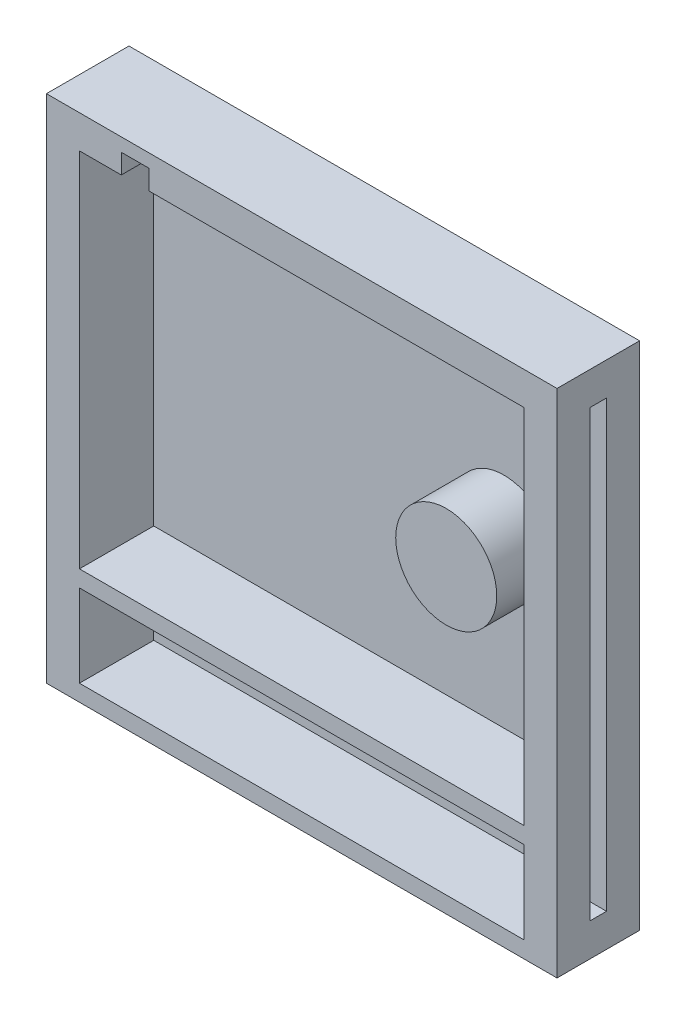
ISO-10303-21;
HEADER;
FILE_DESCRIPTION(('STEP AP214'),'2;1');
FILE_NAME('part.step','',(''),(''),'','','');
FILE_SCHEMA(('AUTOMOTIVE_DESIGN { 1 0 10303 214 1 1 1 1 }'));
ENDSEC;
DATA;
#1=APPLICATION_CONTEXT('core data for automotive mechanical design processes');
#2=APPLICATION_PROTOCOL_DEFINITION('international standard','automotive_design',2000,#1);
#3=PRODUCT_CONTEXT('',#1,'mechanical');
#4=PRODUCT('Part','Part','',(#3));
#5=PRODUCT_RELATED_PRODUCT_CATEGORY('part','',(#4));
#6=PRODUCT_DEFINITION_FORMATION('','',#4);
#7=PRODUCT_DEFINITION_CONTEXT('part definition',#1,'design');
#8=PRODUCT_DEFINITION('design','',#6,#7);
#9=PRODUCT_DEFINITION_SHAPE('','',#8);
#10=(LENGTH_UNIT() NAMED_UNIT(*) SI_UNIT(.MILLI.,.METRE.));
#11=(NAMED_UNIT(*) PLANE_ANGLE_UNIT() SI_UNIT($,.RADIAN.));
#12=(NAMED_UNIT(*) SI_UNIT($,.STERADIAN.) SOLID_ANGLE_UNIT());
#13=UNCERTAINTY_MEASURE_WITH_UNIT(LENGTH_MEASURE(1.E-05),#10,'distance_accuracy_value','');
#14=(GEOMETRIC_REPRESENTATION_CONTEXT(3) GLOBAL_UNCERTAINTY_ASSIGNED_CONTEXT((#13)) GLOBAL_UNIT_ASSIGNED_CONTEXT((#10,
#11,#12)) REPRESENTATION_CONTEXT('',''));
#15=CARTESIAN_POINT('',(0.,0.,0.));
#16=DIRECTION('',(0.,0.,1.));
#17=DIRECTION('',(1.,0.,0.));
#18=AXIS2_PLACEMENT_3D('',#15,#16,#17);
#19=CARTESIAN_POINT('',(78.5678966446695,78.5678966446696,25.4));
#20=DIRECTION('',(-1.,0.,0.));
#21=DIRECTION('',(0.,-1.,0.));
#22=AXIS2_PLACEMENT_3D('',#19,#20,#21);
#23=PLANE('',#22);
#24=DIRECTION('',(0.,1.,0.));
#25=VECTOR('',#24,1.);
#26=CARTESIAN_POINT('',(78.5678966446695,78.5678966446696,0.));
#27=LINE('',#26,#25);
#28=CARTESIAN_POINT('',(78.5678966446696,-78.5678966446696,0.));
#29=VERTEX_POINT('',#28);
#30=CARTESIAN_POINT('',(78.5678966446695,78.5678966446696,0.));
#31=VERTEX_POINT('',#30);
#32=EDGE_CURVE('E363',#29,#31,#27,.T.);
#33=ORIENTED_EDGE('',*,*,#32,.T.);
#34=DIRECTION('',(0.,0.,-1.));
#35=VECTOR('',#34,1.);
#36=CARTESIAN_POINT('',(78.5678966446695,78.5678966446696,25.4));
#37=LINE('',#36,#35);
#38=CARTESIAN_POINT('',(78.5678966446695,78.5678966446696,25.4));
#39=VERTEX_POINT('',#38);
#40=EDGE_CURVE('E368',#39,#31,#37,.T.);
#41=ORIENTED_EDGE('',*,*,#40,.F.);
#42=DIRECTION('',(0.,1.,0.));
#43=VECTOR('',#42,1.);
#44=CARTESIAN_POINT('',(78.5678966446695,78.5678966446696,25.4));
#45=LINE('',#44,#43);
#46=CARTESIAN_POINT('',(78.5678966446696,-78.5678966446696,25.4));
#47=VERTEX_POINT('',#46);
#48=EDGE_CURVE('E354',#47,#39,#45,.T.);
#49=ORIENTED_EDGE('',*,*,#48,.F.);
#50=DIRECTION('',(0.,0.,-1.));
#51=VECTOR('',#50,1.);
#52=CARTESIAN_POINT('',(78.5678966446696,-78.5678966446696,25.4));
#53=LINE('',#52,#51);
#54=EDGE_CURVE('E371',#47,#29,#53,.T.);
#55=ORIENTED_EDGE('',*,*,#54,.T.);
#56=EDGE_LOOP('',(#33,#41,#49,#55));
#57=FACE_BOUND('',#56,.T.);
#58=DIRECTION('',(0.,1.,0.));
#59=VECTOR('',#58,1.);
#60=CARTESIAN_POINT('',(78.5678966446695,-68.4078966446696,15.24));
#61=LINE('',#60,#59);
#62=CARTESIAN_POINT('',(78.5678966446696,-68.4078966446696,15.24));
#63=VERTEX_POINT('',#62);
#64=CARTESIAN_POINT('',(78.5678966446696,68.4078966446695,15.24));
#65=VERTEX_POINT('',#64);
#66=EDGE_CURVE('E57',#63,#65,#61,.T.);
#67=ORIENTED_EDGE('',*,*,#66,.T.);
#68=DIRECTION('',(0.,0.,-1.));
#69=VECTOR('',#68,1.);
#70=CARTESIAN_POINT('',(78.5678966446696,68.4078966446695,15.24));
#71=LINE('',#70,#69);
#72=CARTESIAN_POINT('',(78.5678966446696,68.4078966446695,10.16));
#73=VERTEX_POINT('',#72);
#74=EDGE_CURVE('E229',#65,#73,#71,.T.);
#75=ORIENTED_EDGE('',*,*,#74,.T.);
#76=DIRECTION('',(0.,-1.,0.));
#77=VECTOR('',#76,1.);
#78=CARTESIAN_POINT('',(78.5678966446695,-68.4078966446696,10.16));
#79=LINE('',#78,#77);
#80=CARTESIAN_POINT('',(78.5678966446695,-68.4078966446696,10.16));
#81=VERTEX_POINT('',#80);
#82=EDGE_CURVE('E240',#73,#81,#79,.T.);
#83=ORIENTED_EDGE('',*,*,#82,.T.);
#84=DIRECTION('',(0.,0.,1.));
#85=VECTOR('',#84,1.);
#86=CARTESIAN_POINT('',(78.5678966446695,-68.4078966446696,15.24));
#87=LINE('',#86,#85);
#88=EDGE_CURVE('E237',#81,#63,#87,.T.);
#89=ORIENTED_EDGE('',*,*,#88,.T.);
#90=EDGE_LOOP('',(#67,#75,#83,#89));
#91=FACE_BOUND('',#90,.T.);
#92=ADVANCED_FACE('F34',(#57,#91),#23,.F.);
#93=CARTESIAN_POINT('',(-78.5678966446696,78.5678966446695,25.4));
#94=DIRECTION('',(1.,0.,0.));
#95=DIRECTION('',(0.,1.,0.));
#96=AXIS2_PLACEMENT_3D('',#93,#94,#95);
#97=PLANE('',#96);
#98=DIRECTION('',(0.,0.,-1.));
#99=VECTOR('',#98,1.);
#100=CARTESIAN_POINT('',(-78.5678966446696,68.4078966446695,15.24));
#101=LINE('',#100,#99);
#102=CARTESIAN_POINT('',(-78.5678966446696,68.4078966446695,15.24));
#103=VERTEX_POINT('',#102);
#104=CARTESIAN_POINT('',(-78.5678966446696,68.4078966446695,10.16));
#105=VERTEX_POINT('',#104);
#106=EDGE_CURVE('E268',#103,#105,#101,.T.);
#107=ORIENTED_EDGE('',*,*,#106,.F.);
#108=DIRECTION('',(0.,1.,0.));
#109=VECTOR('',#108,1.);
#110=CARTESIAN_POINT('',(-78.5678966446695,-68.4078966446696,15.24));
#111=LINE('',#110,#109);
#112=CARTESIAN_POINT('',(-78.5678966446695,-68.4078966446696,15.24));
#113=VERTEX_POINT('',#112);
#114=EDGE_CURVE('E247',#113,#103,#111,.T.);
#115=ORIENTED_EDGE('',*,*,#114,.F.);
#116=DIRECTION('',(0.,0.,1.));
#117=VECTOR('',#116,1.);
#118=CARTESIAN_POINT('',(-78.5678966446695,-68.4078966446696,15.24));
#119=LINE('',#118,#117);
#120=CARTESIAN_POINT('',(-78.5678966446695,-68.4078966446696,10.16));
#121=VERTEX_POINT('',#120);
#122=EDGE_CURVE('E257',#121,#113,#119,.T.);
#123=ORIENTED_EDGE('',*,*,#122,.F.);
#124=DIRECTION('',(0.,-1.,0.));
#125=VECTOR('',#124,1.);
#126=CARTESIAN_POINT('',(-78.5678966446695,-68.4078966446696,10.16));
#127=LINE('',#126,#125);
#128=EDGE_CURVE('E271',#105,#121,#127,.T.);
#129=ORIENTED_EDGE('',*,*,#128,.F.);
#130=EDGE_LOOP('',(#107,#115,#123,#129));
#131=FACE_BOUND('',#130,.T.);
#132=DIRECTION('',(0.,-1.,0.));
#133=VECTOR('',#132,1.);
#134=CARTESIAN_POINT('',(-78.5678966446696,78.5678966446695,0.));
#135=LINE('',#134,#133);
#136=CARTESIAN_POINT('',(-78.5678966446696,78.5678966446695,0.));
#137=VERTEX_POINT('',#136);
#138=CARTESIAN_POINT('',(-78.5678966446695,-78.5678966446696,0.));
#139=VERTEX_POINT('',#138);
#140=EDGE_CURVE('E347',#137,#139,#135,.T.);
#141=ORIENTED_EDGE('',*,*,#140,.T.);
#142=DIRECTION('',(0.,0.,-1.));
#143=VECTOR('',#142,1.);
#144=CARTESIAN_POINT('',(-78.5678966446695,-78.5678966446696,25.4));
#145=LINE('',#144,#143);
#146=CARTESIAN_POINT('',(-78.5678966446695,-78.5678966446696,25.4));
#147=VERTEX_POINT('',#146);
#148=EDGE_CURVE('E42',#147,#139,#145,.T.);
#149=ORIENTED_EDGE('',*,*,#148,.F.);
#150=DIRECTION('',(0.,-1.,0.));
#151=VECTOR('',#150,1.);
#152=CARTESIAN_POINT('',(-78.5678966446696,78.5678966446695,25.4));
#153=LINE('',#152,#151);
#154=CARTESIAN_POINT('',(-78.5678966446696,78.5678966446695,25.4));
#155=VERTEX_POINT('',#154);
#156=EDGE_CURVE('E348',#155,#147,#153,.T.);
#157=ORIENTED_EDGE('',*,*,#156,.F.);
#158=DIRECTION('',(0.,0.,-1.));
#159=VECTOR('',#158,1.);
#160=CARTESIAN_POINT('',(-78.5678966446696,78.5678966446695,25.4));
#161=LINE('',#160,#159);
#162=EDGE_CURVE('E358',#155,#137,#161,.T.);
#163=ORIENTED_EDGE('',*,*,#162,.T.);
#164=EDGE_LOOP('',(#141,#149,#157,#163));
#165=FACE_BOUND('',#164,.T.);
#166=ADVANCED_FACE('F36',(#131,#165),#97,.F.);
#167=CARTESIAN_POINT('',(78.5678966446696,-78.5678966446696,25.4));
#168=DIRECTION('',(0.,1.,0.));
#169=DIRECTION('',(-1.,0.,0.));
#170=AXIS2_PLACEMENT_3D('',#167,#168,#169);
#171=PLANE('',#170);
#172=DIRECTION('',(1.,0.,0.));
#173=VECTOR('',#172,1.);
#174=CARTESIAN_POINT('',(78.5678966446696,-78.5678966446696,0.));
#175=LINE('',#174,#173);
#176=EDGE_CURVE('E361',#139,#29,#175,.T.);
#177=ORIENTED_EDGE('',*,*,#176,.T.);
#178=ORIENTED_EDGE('',*,*,#54,.F.);
#179=DIRECTION('',(1.,0.,0.));
#180=VECTOR('',#179,1.);
#181=CARTESIAN_POINT('',(78.5678966446696,-78.5678966446696,25.4));
#182=LINE('',#181,#180);
#183=EDGE_CURVE('E351',#147,#47,#182,.T.);
#184=ORIENTED_EDGE('',*,*,#183,.F.);
#185=ORIENTED_EDGE('',*,*,#148,.T.);
#186=EDGE_LOOP('',(#177,#178,#184,#185));
#187=FACE_BOUND('',#186,.T.);
#188=ADVANCED_FACE('F376',(#187),#171,.F.);
#189=CARTESIAN_POINT('',(78.5678966446695,78.5678966446696,25.4));
#190=DIRECTION('',(0.,-1.,0.));
#191=DIRECTION('',(1.,0.,0.));
#192=AXIS2_PLACEMENT_3D('',#189,#190,#191);
#193=PLANE('',#192);
#194=DIRECTION('',(-1.,0.,0.));
#195=VECTOR('',#194,1.);
#196=CARTESIAN_POINT('',(78.5678966446695,78.5678966446696,0.));
#197=LINE('',#196,#195);
#198=EDGE_CURVE('E352',#31,#137,#197,.T.);
#199=ORIENTED_EDGE('',*,*,#198,.T.);
#200=ORIENTED_EDGE('',*,*,#162,.F.);
#201=DIRECTION('',(-1.,0.,0.));
#202=VECTOR('',#201,1.);
#203=CARTESIAN_POINT('',(78.5678966446695,78.5678966446696,25.4));
#204=LINE('',#203,#202);
#205=EDGE_CURVE('E356',#39,#155,#204,.T.);
#206=ORIENTED_EDGE('',*,*,#205,.F.);
#207=ORIENTED_EDGE('',*,*,#40,.T.);
#208=EDGE_LOOP('',(#199,#200,#206,#207));
#209=FACE_BOUND('',#208,.T.);
#210=ADVANCED_FACE('F392',(#209),#193,.F.);
#211=CARTESIAN_POINT('',(0.,0.,25.4));
#212=DIRECTION('',(0.,0.,-1.));
#213=DIRECTION('',(-1.,0.,0.));
#214=AXIS2_PLACEMENT_3D('',#211,#212,#213);
#215=PLANE('',#214);
#216=DIRECTION('',(0.,-1.,0.));
#217=VECTOR('',#216,1.);
#218=CARTESIAN_POINT('',(-68.4078966446696,-48.0878966446696,25.4));
#219=LINE('',#218,#217);
#220=CARTESIAN_POINT('',(-68.4078966446696,-48.0878966446696,25.4));
#221=VERTEX_POINT('',#220);
#222=CARTESIAN_POINT('',(-68.4078966446696,-73.4878966446696,25.4));
#223=VERTEX_POINT('',#222);
#224=EDGE_CURVE('E288',#221,#223,#219,.T.);
#225=ORIENTED_EDGE('',*,*,#224,.F.);
#226=DIRECTION('',(-1.,0.,0.));
#227=VECTOR('',#226,1.);
#228=CARTESIAN_POINT('',(68.4078966446696,-48.0878966446696,25.4));
#229=LINE('',#228,#227);
#230=CARTESIAN_POINT('',(68.4078966446696,-48.0878966446696,25.4));
#231=VERTEX_POINT('',#230);
#232=EDGE_CURVE('E291',#231,#221,#229,.T.);
#233=ORIENTED_EDGE('',*,*,#232,.F.);
#234=DIRECTION('',(0.,1.,0.));
#235=VECTOR('',#234,1.);
#236=CARTESIAN_POINT('',(68.4078966446696,-48.0878966446696,25.4));
#237=LINE('',#236,#235);
#238=CARTESIAN_POINT('',(68.4078966446696,-73.4878966446696,25.4));
#239=VERTEX_POINT('',#238);
#240=EDGE_CURVE('E278',#239,#231,#237,.T.);
#241=ORIENTED_EDGE('',*,*,#240,.F.);
#242=DIRECTION('',(1.,0.,0.));
#243=VECTOR('',#242,1.);
#244=CARTESIAN_POINT('',(68.4078966446696,-73.4878966446696,25.4));
#245=LINE('',#244,#243);
#246=EDGE_CURVE('E285',#223,#239,#245,.T.);
#247=ORIENTED_EDGE('',*,*,#246,.F.);
#248=EDGE_LOOP('',(#225,#233,#241,#247));
#249=FACE_BOUND('',#248,.T.);
#250=DIRECTION('',(-1.,0.,0.));
#251=VECTOR('',#250,1.);
#252=CARTESIAN_POINT('',(0.,68.4078966446696,25.4));
#253=LINE('',#252,#251);
#254=CARTESIAN_POINT('',(-55.5371323051972,68.4078966446696,25.4));
#255=VERTEX_POINT('',#254);
#256=CARTESIAN_POINT('',(-68.4078966446696,68.4078966446696,25.4));
#257=VERTEX_POINT('',#256);
#258=EDGE_CURVE('E319',#255,#257,#253,.T.);
#259=ORIENTED_EDGE('',*,*,#258,.F.);
#260=DIRECTION('',(0.,-1.,0.));
#261=VECTOR('',#260,1.);
#262=CARTESIAN_POINT('',(-55.5371323051972,74.4707776309536,25.4));
#263=LINE('',#262,#261);
#264=CARTESIAN_POINT('',(-55.5371323051972,74.4707776309536,25.4));
#265=VERTEX_POINT('',#264);
#266=EDGE_CURVE('E699',#265,#255,#263,.T.);
#267=ORIENTED_EDGE('',*,*,#266,.F.);
#268=DIRECTION('',(-1.,0.,0.));
#269=VECTOR('',#268,1.);
#270=CARTESIAN_POINT('',(-55.5371323051972,74.4707776309536,25.4));
#271=LINE('',#270,#269);
#272=CARTESIAN_POINT('',(-47.0507568190186,74.4707776309536,25.4));
#273=VERTEX_POINT('',#272);
#274=EDGE_CURVE('E704',#273,#265,#271,.T.);
#275=ORIENTED_EDGE('',*,*,#274,.F.);
#276=DIRECTION('',(0.,1.,0.));
#277=VECTOR('',#276,1.);
#278=CARTESIAN_POINT('',(-47.0507568190186,74.4707776309536,25.4));
#279=LINE('',#278,#277);
#280=CARTESIAN_POINT('',(-47.0507568190186,68.4078966446696,25.4));
#281=VERTEX_POINT('',#280);
#282=EDGE_CURVE('E701',#281,#273,#279,.T.);
#283=ORIENTED_EDGE('',*,*,#282,.F.);
#284=CARTESIAN_POINT('',(68.4078966446696,68.4078966446696,25.4));
#285=VERTEX_POINT('',#284);
#286=EDGE_CURVE('E217',#285,#281,#253,.T.);
#287=ORIENTED_EDGE('',*,*,#286,.F.);
#288=DIRECTION('',(0.,-1.,0.));
#289=VECTOR('',#288,1.);
#290=CARTESIAN_POINT('',(68.4078966446696,0.,25.4));
#291=LINE('',#290,#289);
#292=CARTESIAN_POINT('',(68.4078966446696,-43.0078966446696,25.4));
#293=VERTEX_POINT('',#292);
#294=EDGE_CURVE('E320',#285,#293,#291,.T.);
#295=ORIENTED_EDGE('',*,*,#294,.T.);
#296=DIRECTION('',(1.,0.,0.));
#297=VECTOR('',#296,1.);
#298=CARTESIAN_POINT('',(0.,-43.0078966446696,25.4));
#299=LINE('',#298,#297);
#300=CARTESIAN_POINT('',(-68.4078966446696,-43.0078966446696,25.4));
#301=VERTEX_POINT('',#300);
#302=EDGE_CURVE('E325',#301,#293,#299,.T.);
#303=ORIENTED_EDGE('',*,*,#302,.F.);
#304=DIRECTION('',(0.,-1.,0.));
#305=VECTOR('',#304,1.);
#306=CARTESIAN_POINT('',(-68.4078966446696,0.,25.4));
#307=LINE('',#306,#305);
#308=EDGE_CURVE('E328',#257,#301,#307,.T.);
#309=ORIENTED_EDGE('',*,*,#308,.F.);
#310=EDGE_LOOP('',(#259,#267,#275,#283,#287,#295,#303,#309));
#311=FACE_BOUND('',#310,.T.);
#312=ORIENTED_EDGE('',*,*,#156,.T.);
#313=ORIENTED_EDGE('',*,*,#183,.T.);
#314=ORIENTED_EDGE('',*,*,#48,.T.);
#315=ORIENTED_EDGE('',*,*,#205,.T.);
#316=EDGE_LOOP('',(#312,#313,#314,#315));
#317=FACE_BOUND('',#316,.T.);
#318=ADVANCED_FACE('F394',(#249,#311,#317),#215,.F.);
#319=CARTESIAN_POINT('',(0.,0.,0.));
#320=DIRECTION('',(0.,0.,-1.));
#321=DIRECTION('',(-1.,0.,0.));
#322=AXIS2_PLACEMENT_3D('',#319,#320,#321);
#323=PLANE('',#322);
#324=ORIENTED_EDGE('',*,*,#140,.F.);
#325=ORIENTED_EDGE('',*,*,#198,.F.);
#326=ORIENTED_EDGE('',*,*,#32,.F.);
#327=ORIENTED_EDGE('',*,*,#176,.F.);
#328=EDGE_LOOP('',(#324,#325,#326,#327));
#329=FACE_BOUND('',#328,.T.);
#330=ADVANCED_FACE('F384',(#329),#323,.T.);
#331=CARTESIAN_POINT('',(0.,0.,2.54));
#332=DIRECTION('',(0.,0.,-1.));
#333=DIRECTION('',(-1.,0.,0.));
#334=AXIS2_PLACEMENT_3D('',#331,#332,#333);
#335=PLANE('',#334);
#336=CARTESIAN_POINT('',(39.3912837456988,8.89894553217759,2.54));
#337=DIRECTION('',(0.,0.,-1.));
#338=DIRECTION('',(-1.,0.,0.));
#339=AXIS2_PLACEMENT_3D('',#336,#337,#338);
#340=CIRCLE('',#339,15.5472067606427);
#341=CARTESIAN_POINT('',(23.8440769850561,8.89894553217759,2.54));
#342=VERTEX_POINT('',#341);
#343=EDGE_CURVE('E12',#342,#342,#340,.F.);
#344=ORIENTED_EDGE('',*,*,#343,.F.);
#345=EDGE_LOOP('',(#344));
#346=FACE_BOUND('',#345,.T.);
#347=DIRECTION('',(0.,-1.,0.));
#348=VECTOR('',#347,1.);
#349=CARTESIAN_POINT('',(-68.4078966446696,0.,2.53999999999999));
#350=LINE('',#349,#348);
#351=CARTESIAN_POINT('',(-68.4078966446696,68.4078966446696,2.53999999999999));
#352=VERTEX_POINT('',#351);
#353=CARTESIAN_POINT('',(-68.4078966446696,-43.0078966446696,2.53999999999999));
#354=VERTEX_POINT('',#353);
#355=EDGE_CURVE('E334',#352,#354,#350,.T.);
#356=ORIENTED_EDGE('',*,*,#355,.T.);
#357=DIRECTION('',(1.,0.,0.));
#358=VECTOR('',#357,1.);
#359=CARTESIAN_POINT('',(0.,-43.0078966446696,2.53999999999999));
#360=LINE('',#359,#358);
#361=CARTESIAN_POINT('',(68.4078966446696,-43.0078966446696,2.53999999999999));
#362=VERTEX_POINT('',#361);
#363=EDGE_CURVE('E318',#354,#362,#360,.T.);
#364=ORIENTED_EDGE('',*,*,#363,.T.);
#365=DIRECTION('',(0.,-1.,0.));
#366=VECTOR('',#365,1.);
#367=CARTESIAN_POINT('',(68.4078966446696,0.,2.53999999999999));
#368=LINE('',#367,#366);
#369=CARTESIAN_POINT('',(68.4078966446696,68.4078966446696,2.53999999999999));
#370=VERTEX_POINT('',#369);
#371=EDGE_CURVE('E316',#370,#362,#368,.T.);
#372=ORIENTED_EDGE('',*,*,#371,.F.);
#373=DIRECTION('',(-1.,0.,0.));
#374=VECTOR('',#373,1.);
#375=CARTESIAN_POINT('',(0.,68.4078966446696,2.53999999999999));
#376=LINE('',#375,#374);
#377=EDGE_CURVE('E323',#370,#352,#376,.T.);
#378=ORIENTED_EDGE('',*,*,#377,.T.);
#379=EDGE_LOOP('',(#356,#364,#372,#378));
#380=FACE_BOUND('',#379,.T.);
#381=ADVANCED_FACE('F402',(#346,#380),#335,.F.);
#382=CARTESIAN_POINT('',(0.,-43.0078966446696,-176.442739402005));
#383=DIRECTION('',(0.,-1.,0.));
#384=DIRECTION('',(0.,0.,-1.));
#385=AXIS2_PLACEMENT_3D('',#382,#383,#384);
#386=PLANE('',#385);
#387=DIRECTION('',(0.,0.,1.));
#388=VECTOR('',#387,1.);
#389=CARTESIAN_POINT('',(-68.4078966446696,-43.0078966446696,-176.442739402005));
#390=LINE('',#389,#388);
#391=EDGE_CURVE('E337',#354,#301,#390,.T.);
#392=ORIENTED_EDGE('',*,*,#391,.T.);
#393=ORIENTED_EDGE('',*,*,#302,.T.);
#394=DIRECTION('',(0.,0.,1.));
#395=VECTOR('',#394,1.);
#396=CARTESIAN_POINT('',(68.4078966446696,-43.0078966446696,-176.442739402005));
#397=LINE('',#396,#395);
#398=EDGE_CURVE('E333',#362,#293,#397,.T.);
#399=ORIENTED_EDGE('',*,*,#398,.F.);
#400=ORIENTED_EDGE('',*,*,#363,.F.);
#401=EDGE_LOOP('',(#392,#393,#399,#400));
#402=FACE_BOUND('',#401,.T.);
#403=ADVANCED_FACE('F437',(#402),#386,.F.);
#404=CARTESIAN_POINT('',(68.4078966446696,0.,-176.442739402005));
#405=DIRECTION('',(-1.,0.,0.));
#406=DIRECTION('',(0.,0.,1.));
#407=AXIS2_PLACEMENT_3D('',#404,#405,#406);
#408=PLANE('',#407);
#409=ORIENTED_EDGE('',*,*,#371,.T.);
#410=ORIENTED_EDGE('',*,*,#398,.T.);
#411=ORIENTED_EDGE('',*,*,#294,.F.);
#412=DIRECTION('',(0.,0.,1.));
#413=VECTOR('',#412,1.);
#414=CARTESIAN_POINT('',(68.4078966446696,68.4078966446696,-176.442739402005));
#415=LINE('',#414,#413);
#416=EDGE_CURVE('E324',#370,#285,#415,.T.);
#417=ORIENTED_EDGE('',*,*,#416,.F.);
#418=EDGE_LOOP('',(#409,#410,#411,#417));
#419=FACE_BOUND('',#418,.T.);
#420=ADVANCED_FACE('F442',(#419),#408,.T.);
#421=CARTESIAN_POINT('',(0.,68.4078966446696,-176.442739402005));
#422=DIRECTION('',(0.,1.,0.));
#423=DIRECTION('',(0.,0.,1.));
#424=AXIS2_PLACEMENT_3D('',#421,#422,#423);
#425=PLANE('',#424);
#426=DIRECTION('',(1.,0.,0.));
#427=VECTOR('',#426,1.);
#428=CARTESIAN_POINT('',(-55.5371323051972,68.4078966446696,10.16));
#429=LINE('',#428,#427);
#430=CARTESIAN_POINT('',(-55.5371323051972,68.4078966446696,10.16));
#431=VERTEX_POINT('',#430);
#432=CARTESIAN_POINT('',(-47.0507568190186,68.4078966446696,10.16));
#433=VERTEX_POINT('',#432);
#434=EDGE_CURVE('E207',#431,#433,#429,.T.);
#435=ORIENTED_EDGE('',*,*,#434,.F.);
#436=DIRECTION('',(0.,0.,1.));
#437=VECTOR('',#436,1.);
#438=CARTESIAN_POINT('',(-55.5371323051972,68.4078966446696,10.16));
#439=LINE('',#438,#437);
#440=EDGE_CURVE('E218',#431,#255,#439,.T.);
#441=ORIENTED_EDGE('',*,*,#440,.T.);
#442=ORIENTED_EDGE('',*,*,#258,.T.);
#443=DIRECTION('',(0.,0.,1.));
#444=VECTOR('',#443,1.);
#445=CARTESIAN_POINT('',(-68.4078966446696,68.4078966446696,-176.442739402005));
#446=LINE('',#445,#444);
#447=EDGE_CURVE('E338',#352,#257,#446,.T.);
#448=ORIENTED_EDGE('',*,*,#447,.F.);
#449=ORIENTED_EDGE('',*,*,#377,.F.);
#450=ORIENTED_EDGE('',*,*,#416,.T.);
#451=ORIENTED_EDGE('',*,*,#286,.T.);
#452=DIRECTION('',(0.,0.,1.));
#453=VECTOR('',#452,1.);
#454=CARTESIAN_POINT('',(-47.0507568190186,68.4078966446696,10.16));
#455=LINE('',#454,#453);
#456=EDGE_CURVE('E202',#433,#281,#455,.T.);
#457=ORIENTED_EDGE('',*,*,#456,.F.);
#458=EDGE_LOOP('',(#435,#441,#442,#448,#449,#450,#451,#457));
#459=FACE_BOUND('',#458,.T.);
#460=ADVANCED_FACE('F215',(#459),#425,.F.);
#461=CARTESIAN_POINT('',(-68.4078966446696,0.,-176.442739402005));
#462=DIRECTION('',(-1.,0.,0.));
#463=DIRECTION('',(0.,0.,1.));
#464=AXIS2_PLACEMENT_3D('',#461,#462,#463);
#465=PLANE('',#464);
#466=ORIENTED_EDGE('',*,*,#447,.T.);
#467=ORIENTED_EDGE('',*,*,#308,.T.);
#468=ORIENTED_EDGE('',*,*,#391,.F.);
#469=ORIENTED_EDGE('',*,*,#355,.F.);
#470=EDGE_LOOP('',(#466,#467,#468,#469));
#471=FACE_BOUND('',#470,.T.);
#472=ADVANCED_FACE('F459',(#471),#465,.F.);
#473=CARTESIAN_POINT('',(0.,0.,2.54));
#474=DIRECTION('',(0.,0.,-1.));
#475=DIRECTION('',(-1.,0.,0.));
#476=AXIS2_PLACEMENT_3D('',#473,#474,#475);
#477=PLANE('',#476);
#478=DIRECTION('',(0.,1.,0.));
#479=VECTOR('',#478,1.);
#480=CARTESIAN_POINT('',(68.4078966446696,-48.0878966446696,2.53999999999999));
#481=LINE('',#480,#479);
#482=CARTESIAN_POINT('',(68.4078966446696,-73.4878966446696,2.53999999999999));
#483=VERTEX_POINT('',#482);
#484=CARTESIAN_POINT('',(68.4078966446696,-48.0878966446696,2.53999999999999));
#485=VERTEX_POINT('',#484);
#486=EDGE_CURVE('E299',#483,#485,#481,.T.);
#487=ORIENTED_EDGE('',*,*,#486,.T.);
#488=DIRECTION('',(-1.,0.,0.));
#489=VECTOR('',#488,1.);
#490=CARTESIAN_POINT('',(68.4078966446696,-48.0878966446696,2.53999999999999));
#491=LINE('',#490,#489);
#492=CARTESIAN_POINT('',(-68.4078966446696,-48.0878966446696,2.53999999999999));
#493=VERTEX_POINT('',#492);
#494=EDGE_CURVE('E287',#485,#493,#491,.T.);
#495=ORIENTED_EDGE('',*,*,#494,.T.);
#496=DIRECTION('',(0.,-1.,0.));
#497=VECTOR('',#496,1.);
#498=CARTESIAN_POINT('',(-68.4078966446696,-48.0878966446696,2.53999999999999));
#499=LINE('',#498,#497);
#500=CARTESIAN_POINT('',(-68.4078966446696,-73.4878966446696,2.53999999999999));
#501=VERTEX_POINT('',#500);
#502=EDGE_CURVE('E308',#493,#501,#499,.T.);
#503=ORIENTED_EDGE('',*,*,#502,.T.);
#504=DIRECTION('',(1.,0.,0.));
#505=VECTOR('',#504,1.);
#506=CARTESIAN_POINT('',(68.4078966446696,-73.4878966446696,2.53999999999999));
#507=LINE('',#506,#505);
#508=EDGE_CURVE('E304',#501,#483,#507,.T.);
#509=ORIENTED_EDGE('',*,*,#508,.T.);
#510=EDGE_LOOP('',(#487,#495,#503,#509));
#511=FACE_BOUND('',#510,.T.);
#512=ADVANCED_FACE('F464',(#511),#477,.F.);
#513=CARTESIAN_POINT('',(68.4078966446696,-48.0878966446696,-139.153588862778));
#514=DIRECTION('',(0.,1.,0.));
#515=DIRECTION('',(0.,0.,1.));
#516=AXIS2_PLACEMENT_3D('',#513,#514,#515);
#517=PLANE('',#516);
#518=DIRECTION('',(0.,0.,1.));
#519=VECTOR('',#518,1.);
#520=CARTESIAN_POINT('',(68.4078966446696,-48.0878966446696,-139.153588862778));
#521=LINE('',#520,#519);
#522=EDGE_CURVE('E302',#485,#231,#521,.T.);
#523=ORIENTED_EDGE('',*,*,#522,.T.);
#524=ORIENTED_EDGE('',*,*,#232,.T.);
#525=DIRECTION('',(0.,0.,1.));
#526=VECTOR('',#525,1.);
#527=CARTESIAN_POINT('',(-68.4078966446696,-48.0878966446696,-139.153588862778));
#528=LINE('',#527,#526);
#529=EDGE_CURVE('E298',#493,#221,#528,.T.);
#530=ORIENTED_EDGE('',*,*,#529,.F.);
#531=ORIENTED_EDGE('',*,*,#494,.F.);
#532=EDGE_LOOP('',(#523,#524,#530,#531));
#533=FACE_BOUND('',#532,.T.);
#534=ADVANCED_FACE('F474',(#533),#517,.F.);
#535=CARTESIAN_POINT('',(-68.4078966446696,-48.0878966446696,-139.153588862778));
#536=DIRECTION('',(-1.,0.,0.));
#537=DIRECTION('',(0.,0.,1.));
#538=AXIS2_PLACEMENT_3D('',#535,#536,#537);
#539=PLANE('',#538);
#540=ORIENTED_EDGE('',*,*,#529,.T.);
#541=ORIENTED_EDGE('',*,*,#224,.T.);
#542=DIRECTION('',(0.,0.,1.));
#543=VECTOR('',#542,1.);
#544=CARTESIAN_POINT('',(-68.4078966446696,-73.4878966446696,-139.153588862778));
#545=LINE('',#544,#543);
#546=EDGE_CURVE('E307',#501,#223,#545,.T.);
#547=ORIENTED_EDGE('',*,*,#546,.F.);
#548=ORIENTED_EDGE('',*,*,#502,.F.);
#549=EDGE_LOOP('',(#540,#541,#547,#548));
#550=FACE_BOUND('',#549,.T.);
#551=ADVANCED_FACE('F484',(#550),#539,.F.);
#552=CARTESIAN_POINT('',(68.4078966446696,-73.4878966446696,-139.153588862778));
#553=DIRECTION('',(0.,-1.,0.));
#554=DIRECTION('',(1.,0.,0.));
#555=AXIS2_PLACEMENT_3D('',#552,#553,#554);
#556=PLANE('',#555);
#557=ORIENTED_EDGE('',*,*,#546,.T.);
#558=ORIENTED_EDGE('',*,*,#246,.T.);
#559=DIRECTION('',(0.,0.,1.));
#560=VECTOR('',#559,1.);
#561=CARTESIAN_POINT('',(68.4078966446696,-73.4878966446696,-139.153588862778));
#562=LINE('',#561,#560);
#563=EDGE_CURVE('E303',#483,#239,#562,.T.);
#564=ORIENTED_EDGE('',*,*,#563,.F.);
#565=ORIENTED_EDGE('',*,*,#508,.F.);
#566=EDGE_LOOP('',(#557,#558,#564,#565));
#567=FACE_BOUND('',#566,.T.);
#568=ADVANCED_FACE('F494',(#567),#556,.F.);
#569=CARTESIAN_POINT('',(68.4078966446696,-48.0878966446696,-139.153588862778));
#570=DIRECTION('',(1.,0.,0.));
#571=DIRECTION('',(0.,0.,-1.));
#572=AXIS2_PLACEMENT_3D('',#569,#570,#571);
#573=PLANE('',#572);
#574=ORIENTED_EDGE('',*,*,#563,.T.);
#575=ORIENTED_EDGE('',*,*,#240,.T.);
#576=ORIENTED_EDGE('',*,*,#522,.F.);
#577=ORIENTED_EDGE('',*,*,#486,.F.);
#578=EDGE_LOOP('',(#574,#575,#576,#577));
#579=FACE_BOUND('',#578,.T.);
#580=ADVANCED_FACE('F504',(#579),#573,.F.);
#581=CARTESIAN_POINT('',(-70.9478966446696,-68.4078966446696,15.24));
#582=DIRECTION('',(0.,0.,1.));
#583=DIRECTION('',(1.,0.,0.));
#584=AXIS2_PLACEMENT_3D('',#581,#582,#583);
#585=PLANE('',#584);
#586=ORIENTED_EDGE('',*,*,#114,.T.);
#587=DIRECTION('',(-1.,0.,0.));
#588=VECTOR('',#587,1.);
#589=CARTESIAN_POINT('',(-70.9478966446696,68.4078966446695,15.24));
#590=LINE('',#589,#588);
#591=CARTESIAN_POINT('',(-70.9478966446696,68.4078966446695,15.24));
#592=VERTEX_POINT('',#591);
#593=EDGE_CURVE('E266',#592,#103,#590,.T.);
#594=ORIENTED_EDGE('',*,*,#593,.F.);
#595=DIRECTION('',(0.,1.,0.));
#596=VECTOR('',#595,1.);
#597=CARTESIAN_POINT('',(-70.9478966446696,-68.4078966446696,15.24));
#598=LINE('',#597,#596);
#599=CARTESIAN_POINT('',(-70.9478966446696,-68.4078966446696,15.24));
#600=VERTEX_POINT('',#599);
#601=EDGE_CURVE('E253',#600,#592,#598,.T.);
#602=ORIENTED_EDGE('',*,*,#601,.F.);
#603=DIRECTION('',(-1.,0.,0.));
#604=VECTOR('',#603,1.);
#605=CARTESIAN_POINT('',(-70.9478966446696,-68.4078966446696,15.24));
#606=LINE('',#605,#604);
#607=EDGE_CURVE('E276',#600,#113,#606,.T.);
#608=ORIENTED_EDGE('',*,*,#607,.T.);
#609=EDGE_LOOP('',(#586,#594,#602,#608));
#610=FACE_BOUND('',#609,.T.);
#611=ADVANCED_FACE('F513',(#610),#585,.F.);
#612=CARTESIAN_POINT('',(-70.9478966446696,-68.4078966446696,15.24));
#613=DIRECTION('',(0.,-1.,0.));
#614=DIRECTION('',(1.,0.,0.));
#615=AXIS2_PLACEMENT_3D('',#612,#613,#614);
#616=PLANE('',#615);
#617=ORIENTED_EDGE('',*,*,#122,.T.);
#618=ORIENTED_EDGE('',*,*,#607,.F.);
#619=DIRECTION('',(0.,0.,1.));
#620=VECTOR('',#619,1.);
#621=CARTESIAN_POINT('',(-70.9478966446696,-68.4078966446696,15.24));
#622=LINE('',#621,#620);
#623=CARTESIAN_POINT('',(-70.9478966446696,-68.4078966446696,10.16));
#624=VERTEX_POINT('',#623);
#625=EDGE_CURVE('E263',#624,#600,#622,.T.);
#626=ORIENTED_EDGE('',*,*,#625,.F.);
#627=DIRECTION('',(-1.,0.,0.));
#628=VECTOR('',#627,1.);
#629=CARTESIAN_POINT('',(-70.9478966446696,-68.4078966446696,10.16));
#630=LINE('',#629,#628);
#631=EDGE_CURVE('E279',#624,#121,#630,.T.);
#632=ORIENTED_EDGE('',*,*,#631,.T.);
#633=EDGE_LOOP('',(#617,#618,#626,#632));
#634=FACE_BOUND('',#633,.T.);
#635=ADVANCED_FACE('F528',(#634),#616,.F.);
#636=CARTESIAN_POINT('',(-70.9478966446696,-68.4078966446696,10.16));
#637=DIRECTION('',(0.,0.,-1.));
#638=DIRECTION('',(-1.,0.,0.));
#639=AXIS2_PLACEMENT_3D('',#636,#637,#638);
#640=PLANE('',#639);
#641=ORIENTED_EDGE('',*,*,#128,.T.);
#642=ORIENTED_EDGE('',*,*,#631,.F.);
#643=DIRECTION('',(0.,-1.,0.));
#644=VECTOR('',#643,1.);
#645=CARTESIAN_POINT('',(-70.9478966446696,-68.4078966446696,10.16));
#646=LINE('',#645,#644);
#647=CARTESIAN_POINT('',(-70.9478966446696,68.4078966446695,10.16));
#648=VERTEX_POINT('',#647);
#649=EDGE_CURVE('E260',#648,#624,#646,.T.);
#650=ORIENTED_EDGE('',*,*,#649,.F.);
#651=DIRECTION('',(-1.,0.,0.));
#652=VECTOR('',#651,1.);
#653=CARTESIAN_POINT('',(-70.9478966446696,68.4078966446695,10.16));
#654=LINE('',#653,#652);
#655=EDGE_CURVE('E281',#648,#105,#654,.T.);
#656=ORIENTED_EDGE('',*,*,#655,.T.);
#657=EDGE_LOOP('',(#641,#642,#650,#656));
#658=FACE_BOUND('',#657,.T.);
#659=ADVANCED_FACE('F538',(#658),#640,.F.);
#660=CARTESIAN_POINT('',(-70.9478966446696,68.4078966446695,15.24));
#661=DIRECTION('',(0.,1.,0.));
#662=DIRECTION('',(-1.,0.,0.));
#663=AXIS2_PLACEMENT_3D('',#660,#661,#662);
#664=PLANE('',#663);
#665=ORIENTED_EDGE('',*,*,#106,.T.);
#666=ORIENTED_EDGE('',*,*,#655,.F.);
#667=DIRECTION('',(0.,0.,-1.));
#668=VECTOR('',#667,1.);
#669=CARTESIAN_POINT('',(-70.9478966446696,68.4078966446695,15.24));
#670=LINE('',#669,#668);
#671=EDGE_CURVE('E256',#592,#648,#670,.T.);
#672=ORIENTED_EDGE('',*,*,#671,.F.);
#673=ORIENTED_EDGE('',*,*,#593,.T.);
#674=EDGE_LOOP('',(#665,#666,#672,#673));
#675=FACE_BOUND('',#674,.T.);
#676=ADVANCED_FACE('F548',(#675),#664,.F.);
#677=CARTESIAN_POINT('',(-70.9478966446696,0.,0.));
#678=DIRECTION('',(-1.,0.,0.));
#679=DIRECTION('',(0.,-1.,0.));
#680=AXIS2_PLACEMENT_3D('',#677,#678,#679);
#681=PLANE('',#680);
#682=ORIENTED_EDGE('',*,*,#601,.T.);
#683=ORIENTED_EDGE('',*,*,#671,.T.);
#684=ORIENTED_EDGE('',*,*,#649,.T.);
#685=ORIENTED_EDGE('',*,*,#625,.T.);
#686=EDGE_LOOP('',(#682,#683,#684,#685));
#687=FACE_BOUND('',#686,.T.);
#688=ADVANCED_FACE('F558',(#687),#681,.T.);
#689=CARTESIAN_POINT('',(70.9478966446696,-68.4078966446696,15.24));
#690=DIRECTION('',(0.,0.,-1.));
#691=DIRECTION('',(-1.,0.,0.));
#692=AXIS2_PLACEMENT_3D('',#689,#690,#691);
#693=PLANE('',#692);
#694=ORIENTED_EDGE('',*,*,#66,.F.);
#695=DIRECTION('',(1.,0.,0.));
#696=VECTOR('',#695,1.);
#697=CARTESIAN_POINT('',(70.9478966446696,-68.4078966446696,15.24));
#698=LINE('',#697,#696);
#699=CARTESIAN_POINT('',(70.9478966446696,-68.4078966446696,15.24));
#700=VERTEX_POINT('',#699);
#701=EDGE_CURVE('E235',#700,#63,#698,.T.);
#702=ORIENTED_EDGE('',*,*,#701,.F.);
#703=DIRECTION('',(0.,1.,0.));
#704=VECTOR('',#703,1.);
#705=CARTESIAN_POINT('',(70.9478966446696,-68.4078966446696,15.24));
#706=LINE('',#705,#704);
#707=CARTESIAN_POINT('',(70.9478966446696,68.4078966446695,15.24));
#708=VERTEX_POINT('',#707);
#709=EDGE_CURVE('E225',#700,#708,#706,.T.);
#710=ORIENTED_EDGE('',*,*,#709,.T.);
#711=DIRECTION('',(1.,0.,0.));
#712=VECTOR('',#711,1.);
#713=CARTESIAN_POINT('',(70.9478966446696,68.4078966446695,15.24));
#714=LINE('',#713,#712);
#715=EDGE_CURVE('E245',#708,#65,#714,.T.);
#716=ORIENTED_EDGE('',*,*,#715,.T.);
#717=EDGE_LOOP('',(#694,#702,#710,#716));
#718=FACE_BOUND('',#717,.T.);
#719=ADVANCED_FACE('F567',(#718),#693,.T.);
#720=CARTESIAN_POINT('',(70.9478966446696,68.4078966446695,15.24));
#721=DIRECTION('',(0.,-1.,0.));
#722=DIRECTION('',(1.,0.,0.));
#723=AXIS2_PLACEMENT_3D('',#720,#721,#722);
#724=PLANE('',#723);
#725=ORIENTED_EDGE('',*,*,#74,.F.);
#726=ORIENTED_EDGE('',*,*,#715,.F.);
#727=DIRECTION('',(0.,0.,-1.));
#728=VECTOR('',#727,1.);
#729=CARTESIAN_POINT('',(70.9478966446696,68.4078966446695,15.24));
#730=LINE('',#729,#728);
#731=CARTESIAN_POINT('',(70.9478966446696,68.4078966446695,10.16));
#732=VERTEX_POINT('',#731);
#733=EDGE_CURVE('E233',#708,#732,#730,.T.);
#734=ORIENTED_EDGE('',*,*,#733,.T.);
#735=DIRECTION('',(1.,0.,0.));
#736=VECTOR('',#735,1.);
#737=CARTESIAN_POINT('',(70.9478966446696,68.4078966446695,10.16));
#738=LINE('',#737,#736);
#739=EDGE_CURVE('E248',#732,#73,#738,.T.);
#740=ORIENTED_EDGE('',*,*,#739,.T.);
#741=EDGE_LOOP('',(#725,#726,#734,#740));
#742=FACE_BOUND('',#741,.T.);
#743=ADVANCED_FACE('F582',(#742),#724,.T.);
#744=CARTESIAN_POINT('',(70.9478966446696,-68.4078966446696,10.16));
#745=DIRECTION('',(0.,0.,1.));
#746=DIRECTION('',(1.,0.,0.));
#747=AXIS2_PLACEMENT_3D('',#744,#745,#746);
#748=PLANE('',#747);
#749=ORIENTED_EDGE('',*,*,#82,.F.);
#750=ORIENTED_EDGE('',*,*,#739,.F.);
#751=DIRECTION('',(0.,-1.,0.));
#752=VECTOR('',#751,1.);
#753=CARTESIAN_POINT('',(70.9478966446696,-68.4078966446696,10.16));
#754=LINE('',#753,#752);
#755=CARTESIAN_POINT('',(70.9478966446696,-68.4078966446696,10.16));
#756=VERTEX_POINT('',#755);
#757=EDGE_CURVE('E231',#732,#756,#754,.T.);
#758=ORIENTED_EDGE('',*,*,#757,.T.);
#759=DIRECTION('',(1.,0.,0.));
#760=VECTOR('',#759,1.);
#761=CARTESIAN_POINT('',(70.9478966446696,-68.4078966446696,10.16));
#762=LINE('',#761,#760);
#763=EDGE_CURVE('E250',#756,#81,#762,.T.);
#764=ORIENTED_EDGE('',*,*,#763,.T.);
#765=EDGE_LOOP('',(#749,#750,#758,#764));
#766=FACE_BOUND('',#765,.T.);
#767=ADVANCED_FACE('F591',(#766),#748,.T.);
#768=CARTESIAN_POINT('',(70.9478966446696,-68.4078966446696,15.24));
#769=DIRECTION('',(0.,1.,0.));
#770=DIRECTION('',(-1.,0.,0.));
#771=AXIS2_PLACEMENT_3D('',#768,#769,#770);
#772=PLANE('',#771);
#773=ORIENTED_EDGE('',*,*,#88,.F.);
#774=ORIENTED_EDGE('',*,*,#763,.F.);
#775=DIRECTION('',(0.,0.,1.));
#776=VECTOR('',#775,1.);
#777=CARTESIAN_POINT('',(70.9478966446696,-68.4078966446696,15.24));
#778=LINE('',#777,#776);
#779=EDGE_CURVE('E228',#756,#700,#778,.T.);
#780=ORIENTED_EDGE('',*,*,#779,.T.);
#781=ORIENTED_EDGE('',*,*,#701,.T.);
#782=EDGE_LOOP('',(#773,#774,#780,#781));
#783=FACE_BOUND('',#782,.T.);
#784=ADVANCED_FACE('F601',(#783),#772,.T.);
#785=CARTESIAN_POINT('',(70.9478966446696,0.,0.));
#786=DIRECTION('',(1.,0.,0.));
#787=DIRECTION('',(0.,-1.,0.));
#788=AXIS2_PLACEMENT_3D('',#785,#786,#787);
#789=PLANE('',#788);
#790=ORIENTED_EDGE('',*,*,#709,.F.);
#791=ORIENTED_EDGE('',*,*,#779,.F.);
#792=ORIENTED_EDGE('',*,*,#757,.F.);
#793=ORIENTED_EDGE('',*,*,#733,.F.);
#794=EDGE_LOOP('',(#790,#791,#792,#793));
#795=FACE_BOUND('',#794,.T.);
#796=ADVANCED_FACE('F611',(#795),#789,.T.);
#797=CARTESIAN_POINT('',(-55.5371323051972,74.4707776309536,10.16));
#798=DIRECTION('',(-1.,0.,0.));
#799=DIRECTION('',(0.,0.,1.));
#800=AXIS2_PLACEMENT_3D('',#797,#798,#799);
#801=PLANE('',#800);
#802=ORIENTED_EDGE('',*,*,#266,.T.);
#803=ORIENTED_EDGE('',*,*,#440,.F.);
#804=DIRECTION('',(0.,-1.,0.));
#805=VECTOR('',#804,1.);
#806=CARTESIAN_POINT('',(-55.5371323051972,74.4707776309536,10.16));
#807=LINE('',#806,#805);
#808=CARTESIAN_POINT('',(-55.5371323051972,74.4707776309536,10.16));
#809=VERTEX_POINT('',#808);
#810=EDGE_CURVE('E49',#809,#431,#807,.T.);
#811=ORIENTED_EDGE('',*,*,#810,.F.);
#812=DIRECTION('',(0.,0.,1.));
#813=VECTOR('',#812,1.);
#814=CARTESIAN_POINT('',(-55.5371323051972,74.4707776309536,10.16));
#815=LINE('',#814,#813);
#816=EDGE_CURVE('E220',#809,#265,#815,.T.);
#817=ORIENTED_EDGE('',*,*,#816,.T.);
#818=EDGE_LOOP('',(#802,#803,#811,#817));
#819=FACE_BOUND('',#818,.T.);
#820=ADVANCED_FACE('F620',(#819),#801,.F.);
#821=CARTESIAN_POINT('',(-55.5371323051972,74.4707776309536,10.16));
#822=DIRECTION('',(0.,1.,0.));
#823=DIRECTION('',(0.,0.,1.));
#824=AXIS2_PLACEMENT_3D('',#821,#822,#823);
#825=PLANE('',#824);
#826=ORIENTED_EDGE('',*,*,#274,.T.);
#827=ORIENTED_EDGE('',*,*,#816,.F.);
#828=DIRECTION('',(-1.,0.,0.));
#829=VECTOR('',#828,1.);
#830=CARTESIAN_POINT('',(-55.5371323051972,74.4707776309536,10.16));
#831=LINE('',#830,#829);
#832=CARTESIAN_POINT('',(-47.0507568190186,74.4707776309536,10.16));
#833=VERTEX_POINT('',#832);
#834=EDGE_CURVE('E206',#833,#809,#831,.T.);
#835=ORIENTED_EDGE('',*,*,#834,.F.);
#836=DIRECTION('',(0.,0.,1.));
#837=VECTOR('',#836,1.);
#838=CARTESIAN_POINT('',(-47.0507568190186,74.4707776309536,10.16));
#839=LINE('',#838,#837);
#840=EDGE_CURVE('E204',#833,#273,#839,.T.);
#841=ORIENTED_EDGE('',*,*,#840,.T.);
#842=EDGE_LOOP('',(#826,#827,#835,#841));
#843=FACE_BOUND('',#842,.T.);
#844=ADVANCED_FACE('F640',(#843),#825,.F.);
#845=CARTESIAN_POINT('',(-47.0507568190186,74.4707776309536,10.16));
#846=DIRECTION('',(1.,0.,0.));
#847=DIRECTION('',(0.,0.,-1.));
#848=AXIS2_PLACEMENT_3D('',#845,#846,#847);
#849=PLANE('',#848);
#850=ORIENTED_EDGE('',*,*,#282,.T.);
#851=ORIENTED_EDGE('',*,*,#840,.F.);
#852=DIRECTION('',(0.,1.,0.));
#853=VECTOR('',#852,1.);
#854=CARTESIAN_POINT('',(-47.0507568190186,74.4707776309536,10.16));
#855=LINE('',#854,#853);
#856=EDGE_CURVE('E198',#433,#833,#855,.T.);
#857=ORIENTED_EDGE('',*,*,#856,.F.);
#858=ORIENTED_EDGE('',*,*,#456,.T.);
#859=EDGE_LOOP('',(#850,#851,#857,#858));
#860=FACE_BOUND('',#859,.T.);
#861=ADVANCED_FACE('F200',(#860),#849,.F.);
#862=CARTESIAN_POINT('',(0.,0.,10.16));
#863=DIRECTION('',(0.,0.,1.));
#864=DIRECTION('',(1.,0.,0.));
#865=AXIS2_PLACEMENT_3D('',#862,#863,#864);
#866=PLANE('',#865);
#867=ORIENTED_EDGE('',*,*,#810,.T.);
#868=ORIENTED_EDGE('',*,*,#434,.T.);
#869=ORIENTED_EDGE('',*,*,#856,.T.);
#870=ORIENTED_EDGE('',*,*,#834,.T.);
#871=EDGE_LOOP('',(#867,#868,#869,#870));
#872=FACE_BOUND('',#871,.T.);
#873=ADVANCED_FACE('F210',(#872),#866,.T.);
#874=CARTESIAN_POINT('',(39.3912837456988,8.89894553217759,20.32));
#875=DIRECTION('',(0.,0.,-1.));
#876=DIRECTION('',(-1.,0.,0.));
#877=AXIS2_PLACEMENT_3D('',#874,#875,#876);
#878=CYLINDRICAL_SURFACE('',#877,15.5472067606427);
#879=CARTESIAN_POINT('',(39.3912837456988,8.89894553217759,20.32));
#880=DIRECTION('',(0.,0.,1.));
#881=DIRECTION('',(1.,0.,0.));
#882=AXIS2_PLACEMENT_3D('',#879,#880,#881);
#883=CIRCLE('',#882,15.5472067606427);
#884=CARTESIAN_POINT('',(54.9384905063415,8.89894553217759,20.32));
#885=VERTEX_POINT('',#884);
#886=EDGE_CURVE('E698',#885,#885,#883,.T.);
#887=ORIENTED_EDGE('',*,*,#886,.F.);
#888=EDGE_LOOP('',(#887));
#889=FACE_BOUND('',#888,.T.);
#890=ORIENTED_EDGE('',*,*,#343,.T.);
#891=EDGE_LOOP('',(#890));
#892=FACE_BOUND('',#891,.T.);
#893=ADVANCED_FACE('F667',(#889,#892),#878,.T.);
#894=CARTESIAN_POINT('',(39.3912837456988,8.89894553217759,20.32));
#895=DIRECTION('',(0.,0.,1.));
#896=DIRECTION('',(1.,0.,0.));
#897=AXIS2_PLACEMENT_3D('',#894,#895,#896);
#898=PLANE('',#897);
#899=ORIENTED_EDGE('',*,*,#886,.T.);
#900=EDGE_LOOP('',(#899));
#901=FACE_BOUND('',#900,.T.);
#902=ADVANCED_FACE('F682',(#901),#898,.T.);
#903=CLOSED_SHELL('',(#92,#166,#188,#210,#318,#330,#381,#403,#420,#460,#472,#512,#534,#551,#568,
#580,#611,#635,#659,#676,#688,#719,#743,#767,#784,#796,#820,#844,#861,#873,#893,#902));
#904=MANIFOLD_SOLID_BREP('B2',#903);
#905=ADVANCED_BREP_SHAPE_REPRESENTATION('',(#18,#904),#14);
#906=SHAPE_DEFINITION_REPRESENTATION(#9,#905);
ENDSEC;
END-ISO-10303-21;
